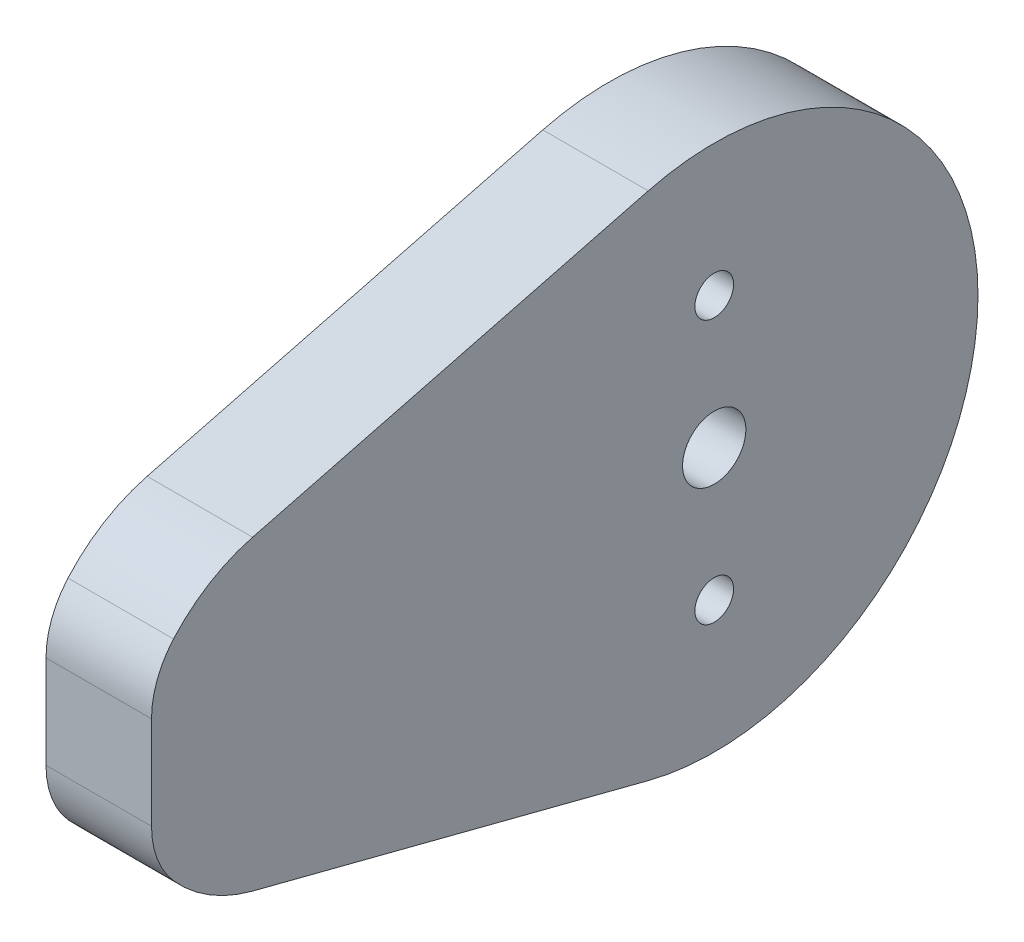
ISO-10303-21;
HEADER;
FILE_DESCRIPTION(('STEP AP214'),'2;1');
FILE_NAME('part.step','',(''),(''),'','','');
FILE_SCHEMA(('AUTOMOTIVE_DESIGN { 1 0 10303 214 1 1 1 1 }'));
ENDSEC;
DATA;
#1=APPLICATION_CONTEXT('core data for automotive mechanical design processes');
#2=APPLICATION_PROTOCOL_DEFINITION('international standard','automotive_design',2000,#1);
#3=PRODUCT_CONTEXT('',#1,'mechanical');
#4=PRODUCT('Part','Part','',(#3));
#5=PRODUCT_RELATED_PRODUCT_CATEGORY('part','',(#4));
#6=PRODUCT_DEFINITION_FORMATION('','',#4);
#7=PRODUCT_DEFINITION_CONTEXT('part definition',#1,'design');
#8=PRODUCT_DEFINITION('design','',#6,#7);
#9=PRODUCT_DEFINITION_SHAPE('','',#8);
#10=(LENGTH_UNIT() NAMED_UNIT(*) SI_UNIT(.MILLI.,.METRE.));
#11=(NAMED_UNIT(*) PLANE_ANGLE_UNIT() SI_UNIT($,.RADIAN.));
#12=(NAMED_UNIT(*) SI_UNIT($,.STERADIAN.) SOLID_ANGLE_UNIT());
#13=UNCERTAINTY_MEASURE_WITH_UNIT(LENGTH_MEASURE(1.E-05),#10,'distance_accuracy_value','');
#14=(GEOMETRIC_REPRESENTATION_CONTEXT(3) GLOBAL_UNCERTAINTY_ASSIGNED_CONTEXT((#13)) GLOBAL_UNIT_ASSIGNED_CONTEXT((#10,
#11,#12)) REPRESENTATION_CONTEXT('',''));
#15=CARTESIAN_POINT('',(0.,0.,0.));
#16=DIRECTION('',(0.,0.,1.));
#17=DIRECTION('',(1.,0.,0.));
#18=AXIS2_PLACEMENT_3D('',#15,#16,#17);
#19=CARTESIAN_POINT('',(6.,44.0457513110646,-34.1));
#20=DIRECTION('',(1.,0.,0.));
#21=DIRECTION('',(0.,0.,-1.));
#22=AXIS2_PLACEMENT_3D('',#19,#20,#21);
#23=PLANE('',#22);
#24=CARTESIAN_POINT('',(6.,48.9,-61.1));
#25=DIRECTION('',(1.,0.,0.));
#26=DIRECTION('',(0.,0.,1.));
#27=AXIS2_PLACEMENT_3D('',#24,#25,#26);
#28=CIRCLE('',#27,1.1);
#29=CARTESIAN_POINT('',(6.,48.9,-60.));
#30=VERTEX_POINT('',#29);
#31=EDGE_CURVE('E181',#30,#30,#28,.T.);
#32=ORIENTED_EDGE('',*,*,#31,.F.);
#33=EDGE_LOOP('',(#32));
#34=FACE_BOUND('',#33,.T.);
#35=CARTESIAN_POINT('',(6.,44.0457513110646,-34.1));
#36=DIRECTION('',(1.,0.,0.));
#37=DIRECTION('',(0.,0.,-1.));
#38=AXIS2_PLACEMENT_3D('',#35,#36,#37);
#39=CIRCLE('',#38,5.);
#40=CARTESIAN_POINT('',(6.,47.3529404498953,-30.35));
#41=VERTEX_POINT('',#40);
#42=CARTESIAN_POINT('',(6.,44.0457513110646,-29.1));
#43=VERTEX_POINT('',#42);
#44=EDGE_CURVE('E144',#41,#43,#39,.T.);
#45=ORIENTED_EDGE('',*,*,#44,.T.);
#46=DIRECTION('',(0.,-1.,0.));
#47=VECTOR('',#46,1.);
#48=CARTESIAN_POINT('',(6.,44.0457513110646,-29.1));
#49=LINE('',#48,#47);
#50=CARTESIAN_POINT('',(6.,38.7542486889354,-29.1));
#51=VERTEX_POINT('',#50);
#52=EDGE_CURVE('E92',#43,#51,#49,.T.);
#53=ORIENTED_EDGE('',*,*,#52,.T.);
#54=CARTESIAN_POINT('',(6.,38.7542486889354,-34.1));
#55=DIRECTION('',(1.,0.,0.));
#56=DIRECTION('',(0.,0.,-1.));
#57=AXIS2_PLACEMENT_3D('',#54,#55,#56);
#58=CIRCLE('',#57,5.);
#59=CARTESIAN_POINT('',(6.,35.4470595501047,-30.35));
#60=VERTEX_POINT('',#59);
#61=EDGE_CURVE('E159',#51,#60,#58,.T.);
#62=ORIENTED_EDGE('',*,*,#61,.T.);
#63=CARTESIAN_POINT('',(6.,41.4,-37.1));
#64=DIRECTION('',(1.,0.,0.));
#65=DIRECTION('',(0.,0.,-1.));
#66=AXIS2_PLACEMENT_3D('',#63,#64,#65);
#67=CIRCLE('',#66,9.00000000000001);
#68=CARTESIAN_POINT('',(6.,32.6857874710333,-34.85));
#69=VERTEX_POINT('',#68);
#70=EDGE_CURVE('E172',#60,#69,#67,.T.);
#71=ORIENTED_EDGE('',*,*,#70,.T.);
#72=DIRECTION('',(0.,-0.25,-0.968245836551854));
#73=VECTOR('',#72,1.);
#74=CARTESIAN_POINT('',(6.,32.6857874710333,-34.85));
#75=LINE('',#74,#73);
#76=CARTESIAN_POINT('',(6.,26.8763124517222,-57.35));
#77=VERTEX_POINT('',#76);
#78=EDGE_CURVE('E111',#69,#77,#75,.T.);
#79=ORIENTED_EDGE('',*,*,#78,.T.);
#80=CARTESIAN_POINT('',(6.,41.4,-61.1));
#81=DIRECTION('',(1.,0.,0.));
#82=DIRECTION('',(0.,0.,-1.));
#83=AXIS2_PLACEMENT_3D('',#80,#81,#82);
#84=CIRCLE('',#83,15.);
#85=CARTESIAN_POINT('',(6.,55.9236875482778,-57.35));
#86=VERTEX_POINT('',#85);
#87=EDGE_CURVE('E105',#77,#86,#84,.T.);
#88=ORIENTED_EDGE('',*,*,#87,.T.);
#89=DIRECTION('',(0.,-0.25,0.968245836551854));
#90=VECTOR('',#89,1.);
#91=CARTESIAN_POINT('',(6.,50.1142125289667,-34.85));
#92=LINE('',#91,#90);
#93=CARTESIAN_POINT('',(6.,50.1142125289667,-34.85));
#94=VERTEX_POINT('',#93);
#95=EDGE_CURVE('E109',#86,#94,#92,.T.);
#96=ORIENTED_EDGE('',*,*,#95,.T.);
#97=CARTESIAN_POINT('',(6.,41.4,-37.1));
#98=DIRECTION('',(1.,0.,0.));
#99=DIRECTION('',(0.,0.,-1.));
#100=AXIS2_PLACEMENT_3D('',#97,#98,#99);
#101=CIRCLE('',#100,9.);
#102=EDGE_CURVE('E49',#94,#41,#101,.T.);
#103=ORIENTED_EDGE('',*,*,#102,.T.);
#104=EDGE_LOOP('',(#45,#53,#62,#71,#79,#88,#96,#103));
#105=FACE_BOUND('',#104,.T.);
#106=CARTESIAN_POINT('',(6.,33.9,-61.1));
#107=DIRECTION('',(1.,0.,0.));
#108=DIRECTION('',(0.,0.,-1.));
#109=AXIS2_PLACEMENT_3D('',#106,#107,#108);
#110=CIRCLE('',#109,1.1);
#111=CARTESIAN_POINT('',(6.,33.9,-62.2));
#112=VERTEX_POINT('',#111);
#113=EDGE_CURVE('E133',#112,#112,#110,.T.);
#114=ORIENTED_EDGE('',*,*,#113,.F.);
#115=EDGE_LOOP('',(#114));
#116=FACE_BOUND('',#115,.T.);
#117=CARTESIAN_POINT('',(6.,41.4,-61.1));
#118=DIRECTION('',(1.,0.,0.));
#119=DIRECTION('',(0.,0.,-1.));
#120=AXIS2_PLACEMENT_3D('',#117,#118,#119);
#121=CIRCLE('',#120,1.79999999999999);
#122=CARTESIAN_POINT('',(6.,41.4,-62.9));
#123=VERTEX_POINT('',#122);
#124=EDGE_CURVE('E187',#123,#123,#121,.T.);
#125=ORIENTED_EDGE('',*,*,#124,.F.);
#126=EDGE_LOOP('',(#125));
#127=FACE_BOUND('',#126,.T.);
#128=ADVANCED_FACE('F32',(#34,#105,#116,#127),#23,.T.);
#129=CARTESIAN_POINT('',(0.,44.0457513110646,-34.1));
#130=DIRECTION('',(1.,0.,0.));
#131=DIRECTION('',(0.,0.,-1.));
#132=AXIS2_PLACEMENT_3D('',#129,#130,#131);
#133=PLANE('',#132);
#134=CARTESIAN_POINT('',(0.,48.9,-61.1));
#135=DIRECTION('',(1.,0.,0.));
#136=DIRECTION('',(0.,0.,1.));
#137=AXIS2_PLACEMENT_3D('',#134,#135,#136);
#138=CIRCLE('',#137,1.1);
#139=CARTESIAN_POINT('',(0.,48.9,-60.));
#140=VERTEX_POINT('',#139);
#141=EDGE_CURVE('E184',#140,#140,#138,.T.);
#142=ORIENTED_EDGE('',*,*,#141,.T.);
#143=EDGE_LOOP('',(#142));
#144=FACE_BOUND('',#143,.T.);
#145=CARTESIAN_POINT('',(0.,44.0457513110646,-34.1));
#146=DIRECTION('',(1.,0.,0.));
#147=DIRECTION('',(0.,0.,-1.));
#148=AXIS2_PLACEMENT_3D('',#145,#146,#147);
#149=CIRCLE('',#148,5.);
#150=CARTESIAN_POINT('',(0.,47.3529404498953,-30.35));
#151=VERTEX_POINT('',#150);
#152=CARTESIAN_POINT('',(0.,44.0457513110646,-29.1));
#153=VERTEX_POINT('',#152);
#154=EDGE_CURVE('E129',#151,#153,#149,.T.);
#155=ORIENTED_EDGE('',*,*,#154,.F.);
#156=CARTESIAN_POINT('',(0.,41.4,-37.1));
#157=DIRECTION('',(1.,0.,0.));
#158=DIRECTION('',(0.,0.,-1.));
#159=AXIS2_PLACEMENT_3D('',#156,#157,#158);
#160=CIRCLE('',#159,9.);
#161=CARTESIAN_POINT('',(0.,50.1142125289667,-34.85));
#162=VERTEX_POINT('',#161);
#163=EDGE_CURVE('E84',#162,#151,#160,.T.);
#164=ORIENTED_EDGE('',*,*,#163,.F.);
#165=DIRECTION('',(0.,-0.25,0.968245836551854));
#166=VECTOR('',#165,1.);
#167=CARTESIAN_POINT('',(0.,50.1142125289667,-34.85));
#168=LINE('',#167,#166);
#169=CARTESIAN_POINT('',(0.,55.9236875482778,-57.35));
#170=VERTEX_POINT('',#169);
#171=EDGE_CURVE('E78',#170,#162,#168,.T.);
#172=ORIENTED_EDGE('',*,*,#171,.F.);
#173=CARTESIAN_POINT('',(0.,41.4,-61.1));
#174=DIRECTION('',(1.,0.,0.));
#175=DIRECTION('',(0.,0.,-1.));
#176=AXIS2_PLACEMENT_3D('',#173,#174,#175);
#177=CIRCLE('',#176,15.);
#178=CARTESIAN_POINT('',(0.,26.8763124517222,-57.35));
#179=VERTEX_POINT('',#178);
#180=EDGE_CURVE('E119',#179,#170,#177,.T.);
#181=ORIENTED_EDGE('',*,*,#180,.F.);
#182=DIRECTION('',(0.,-0.25,-0.968245836551854));
#183=VECTOR('',#182,1.);
#184=CARTESIAN_POINT('',(0.,32.6857874710333,-34.85));
#185=LINE('',#184,#183);
#186=CARTESIAN_POINT('',(0.,32.6857874710333,-34.85));
#187=VERTEX_POINT('',#186);
#188=EDGE_CURVE('E139',#187,#179,#185,.T.);
#189=ORIENTED_EDGE('',*,*,#188,.F.);
#190=CARTESIAN_POINT('',(0.,41.4,-37.1));
#191=DIRECTION('',(1.,0.,0.));
#192=DIRECTION('',(0.,0.,-1.));
#193=AXIS2_PLACEMENT_3D('',#190,#191,#192);
#194=CIRCLE('',#193,9.00000000000001);
#195=CARTESIAN_POINT('',(0.,35.4470595501047,-30.35));
#196=VERTEX_POINT('',#195);
#197=EDGE_CURVE('E137',#196,#187,#194,.T.);
#198=ORIENTED_EDGE('',*,*,#197,.F.);
#199=CARTESIAN_POINT('',(0.,38.7542486889354,-34.1));
#200=DIRECTION('',(1.,0.,0.));
#201=DIRECTION('',(0.,0.,-1.));
#202=AXIS2_PLACEMENT_3D('',#199,#200,#201);
#203=CIRCLE('',#202,5.);
#204=CARTESIAN_POINT('',(0.,38.7542486889354,-29.1));
#205=VERTEX_POINT('',#204);
#206=EDGE_CURVE('E135',#205,#196,#203,.T.);
#207=ORIENTED_EDGE('',*,*,#206,.F.);
#208=DIRECTION('',(0.,-1.,0.));
#209=VECTOR('',#208,1.);
#210=CARTESIAN_POINT('',(0.,44.0457513110646,-29.1));
#211=LINE('',#210,#209);
#212=EDGE_CURVE('E132',#153,#205,#211,.T.);
#213=ORIENTED_EDGE('',*,*,#212,.F.);
#214=EDGE_LOOP('',(#155,#164,#172,#181,#189,#198,#207,#213));
#215=FACE_BOUND('',#214,.T.);
#216=CARTESIAN_POINT('',(0.,33.9,-61.1));
#217=DIRECTION('',(1.,0.,0.));
#218=DIRECTION('',(0.,0.,-1.));
#219=AXIS2_PLACEMENT_3D('',#216,#217,#218);
#220=CIRCLE('',#219,1.1);
#221=CARTESIAN_POINT('',(0.,33.9,-62.2));
#222=VERTEX_POINT('',#221);
#223=EDGE_CURVE('E178',#222,#222,#220,.T.);
#224=ORIENTED_EDGE('',*,*,#223,.T.);
#225=EDGE_LOOP('',(#224));
#226=FACE_BOUND('',#225,.T.);
#227=CARTESIAN_POINT('',(0.,41.4,-61.1));
#228=DIRECTION('',(1.,0.,0.));
#229=DIRECTION('',(0.,0.,-1.));
#230=AXIS2_PLACEMENT_3D('',#227,#228,#229);
#231=CIRCLE('',#230,1.79999999999999);
#232=CARTESIAN_POINT('',(0.,41.4,-62.9));
#233=VERTEX_POINT('',#232);
#234=EDGE_CURVE('E190',#233,#233,#231,.T.);
#235=ORIENTED_EDGE('',*,*,#234,.T.);
#236=EDGE_LOOP('',(#235));
#237=FACE_BOUND('',#236,.T.);
#238=ADVANCED_FACE('F163',(#144,#215,#226,#237),#133,.F.);
#239=CARTESIAN_POINT('',(6.,44.0457513110646,-34.1));
#240=DIRECTION('',(-1.,0.,0.));
#241=DIRECTION('',(0.,0.,1.));
#242=AXIS2_PLACEMENT_3D('',#239,#240,#241);
#243=CYLINDRICAL_SURFACE('',#242,5.);
#244=ORIENTED_EDGE('',*,*,#154,.T.);
#245=DIRECTION('',(-1.,0.,0.));
#246=VECTOR('',#245,1.);
#247=CARTESIAN_POINT('',(6.,44.0457513110646,-29.1));
#248=LINE('',#247,#246);
#249=EDGE_CURVE('E11',#43,#153,#248,.T.);
#250=ORIENTED_EDGE('',*,*,#249,.F.);
#251=ORIENTED_EDGE('',*,*,#44,.F.);
#252=DIRECTION('',(-1.,0.,0.));
#253=VECTOR('',#252,1.);
#254=CARTESIAN_POINT('',(6.,47.3529404498953,-30.35));
#255=LINE('',#254,#253);
#256=EDGE_CURVE('E125',#41,#151,#255,.T.);
#257=ORIENTED_EDGE('',*,*,#256,.T.);
#258=EDGE_LOOP('',(#244,#250,#251,#257));
#259=FACE_BOUND('',#258,.T.);
#260=ADVANCED_FACE('F34',(#259),#243,.T.);
#261=CARTESIAN_POINT('',(6.,44.0457513110646,-29.1));
#262=DIRECTION('',(0.,0.,-1.));
#263=DIRECTION('',(-1.,0.,0.));
#264=AXIS2_PLACEMENT_3D('',#261,#262,#263);
#265=PLANE('',#264);
#266=ORIENTED_EDGE('',*,*,#212,.T.);
#267=DIRECTION('',(-1.,0.,0.));
#268=VECTOR('',#267,1.);
#269=CARTESIAN_POINT('',(6.,38.7542486889354,-29.1));
#270=LINE('',#269,#268);
#271=EDGE_CURVE('E41',#51,#205,#270,.T.);
#272=ORIENTED_EDGE('',*,*,#271,.F.);
#273=ORIENTED_EDGE('',*,*,#52,.F.);
#274=ORIENTED_EDGE('',*,*,#249,.T.);
#275=EDGE_LOOP('',(#266,#272,#273,#274));
#276=FACE_BOUND('',#275,.T.);
#277=ADVANCED_FACE('F224',(#276),#265,.F.);
#278=CARTESIAN_POINT('',(6.,38.7542486889354,-34.1));
#279=DIRECTION('',(-1.,0.,0.));
#280=DIRECTION('',(0.,0.,1.));
#281=AXIS2_PLACEMENT_3D('',#278,#279,#280);
#282=CYLINDRICAL_SURFACE('',#281,5.);
#283=ORIENTED_EDGE('',*,*,#206,.T.);
#284=DIRECTION('',(-1.,0.,0.));
#285=VECTOR('',#284,1.);
#286=CARTESIAN_POINT('',(6.,35.4470595501047,-30.35));
#287=LINE('',#286,#285);
#288=EDGE_CURVE('E151',#60,#196,#287,.T.);
#289=ORIENTED_EDGE('',*,*,#288,.F.);
#290=ORIENTED_EDGE('',*,*,#61,.F.);
#291=ORIENTED_EDGE('',*,*,#271,.T.);
#292=EDGE_LOOP('',(#283,#289,#290,#291));
#293=FACE_BOUND('',#292,.T.);
#294=ADVANCED_FACE('F157',(#293),#282,.T.);
#295=CARTESIAN_POINT('',(6.,41.4,-37.1));
#296=DIRECTION('',(-1.,0.,0.));
#297=DIRECTION('',(0.,0.,1.));
#298=AXIS2_PLACEMENT_3D('',#295,#296,#297);
#299=CYLINDRICAL_SURFACE('',#298,9.00000000000001);
#300=ORIENTED_EDGE('',*,*,#197,.T.);
#301=DIRECTION('',(-1.,0.,0.));
#302=VECTOR('',#301,1.);
#303=CARTESIAN_POINT('',(6.,32.6857874710333,-34.85));
#304=LINE('',#303,#302);
#305=EDGE_CURVE('E148',#69,#187,#304,.T.);
#306=ORIENTED_EDGE('',*,*,#305,.F.);
#307=ORIENTED_EDGE('',*,*,#70,.F.);
#308=ORIENTED_EDGE('',*,*,#288,.T.);
#309=EDGE_LOOP('',(#300,#306,#307,#308));
#310=FACE_BOUND('',#309,.T.);
#311=ADVANCED_FACE('F168',(#310),#299,.T.);
#312=CARTESIAN_POINT('',(6.,32.6857874710333,-34.85));
#313=DIRECTION('',(0.,0.968245836551854,-0.25));
#314=DIRECTION('',(0.,0.25,0.968245836551854));
#315=AXIS2_PLACEMENT_3D('',#312,#313,#314);
#316=PLANE('',#315);
#317=ORIENTED_EDGE('',*,*,#188,.T.);
#318=DIRECTION('',(-1.,0.,0.));
#319=VECTOR('',#318,1.);
#320=CARTESIAN_POINT('',(6.,26.8763124517222,-57.35));
#321=LINE('',#320,#319);
#322=EDGE_CURVE('E120',#77,#179,#321,.T.);
#323=ORIENTED_EDGE('',*,*,#322,.F.);
#324=ORIENTED_EDGE('',*,*,#78,.F.);
#325=ORIENTED_EDGE('',*,*,#305,.T.);
#326=EDGE_LOOP('',(#317,#323,#324,#325));
#327=FACE_BOUND('',#326,.T.);
#328=ADVANCED_FACE('F171',(#327),#316,.F.);
#329=CARTESIAN_POINT('',(6.,41.4,-61.1));
#330=DIRECTION('',(-1.,0.,0.));
#331=DIRECTION('',(0.,0.,1.));
#332=AXIS2_PLACEMENT_3D('',#329,#330,#331);
#333=CYLINDRICAL_SURFACE('',#332,15.);
#334=ORIENTED_EDGE('',*,*,#180,.T.);
#335=DIRECTION('',(-1.,0.,0.));
#336=VECTOR('',#335,1.);
#337=CARTESIAN_POINT('',(6.,55.9236875482778,-57.35));
#338=LINE('',#337,#336);
#339=EDGE_CURVE('E116',#86,#170,#338,.T.);
#340=ORIENTED_EDGE('',*,*,#339,.F.);
#341=ORIENTED_EDGE('',*,*,#87,.F.);
#342=ORIENTED_EDGE('',*,*,#322,.T.);
#343=EDGE_LOOP('',(#334,#340,#341,#342));
#344=FACE_BOUND('',#343,.T.);
#345=ADVANCED_FACE('F117',(#344),#333,.T.);
#346=CARTESIAN_POINT('',(6.,50.1142125289667,-34.85));
#347=DIRECTION('',(0.,-0.968245836551854,-0.25));
#348=DIRECTION('',(0.,0.25,-0.968245836551854));
#349=AXIS2_PLACEMENT_3D('',#346,#347,#348);
#350=PLANE('',#349);
#351=ORIENTED_EDGE('',*,*,#171,.T.);
#352=DIRECTION('',(-1.,0.,0.));
#353=VECTOR('',#352,1.);
#354=CARTESIAN_POINT('',(6.,50.1142125289667,-34.85));
#355=LINE('',#354,#353);
#356=EDGE_CURVE('E121',#94,#162,#355,.T.);
#357=ORIENTED_EDGE('',*,*,#356,.F.);
#358=ORIENTED_EDGE('',*,*,#95,.F.);
#359=ORIENTED_EDGE('',*,*,#339,.T.);
#360=EDGE_LOOP('',(#351,#357,#358,#359));
#361=FACE_BOUND('',#360,.T.);
#362=ADVANCED_FACE('F123',(#361),#350,.F.);
#363=CARTESIAN_POINT('',(6.,41.4,-37.1));
#364=DIRECTION('',(-1.,0.,0.));
#365=DIRECTION('',(0.,0.,1.));
#366=AXIS2_PLACEMENT_3D('',#363,#364,#365);
#367=CYLINDRICAL_SURFACE('',#366,9.);
#368=ORIENTED_EDGE('',*,*,#163,.T.);
#369=ORIENTED_EDGE('',*,*,#256,.F.);
#370=ORIENTED_EDGE('',*,*,#102,.F.);
#371=ORIENTED_EDGE('',*,*,#356,.T.);
#372=EDGE_LOOP('',(#368,#369,#370,#371));
#373=FACE_BOUND('',#372,.T.);
#374=ADVANCED_FACE('F212',(#373),#367,.T.);
#375=CARTESIAN_POINT('',(6.,33.9,-61.1));
#376=DIRECTION('',(-1.,0.,0.));
#377=DIRECTION('',(0.,0.,1.));
#378=AXIS2_PLACEMENT_3D('',#375,#376,#377);
#379=CYLINDRICAL_SURFACE('',#378,1.1);
#380=ORIENTED_EDGE('',*,*,#113,.T.);
#381=EDGE_LOOP('',(#380));
#382=FACE_BOUND('',#381,.T.);
#383=ORIENTED_EDGE('',*,*,#223,.F.);
#384=EDGE_LOOP('',(#383));
#385=FACE_BOUND('',#384,.T.);
#386=ADVANCED_FACE('F209',(#382,#385),#379,.F.);
#387=CARTESIAN_POINT('',(6.,48.9,-61.1));
#388=DIRECTION('',(-1.,0.,0.));
#389=DIRECTION('',(0.,0.,1.));
#390=AXIS2_PLACEMENT_3D('',#387,#388,#389);
#391=CYLINDRICAL_SURFACE('',#390,1.1);
#392=ORIENTED_EDGE('',*,*,#31,.T.);
#393=EDGE_LOOP('',(#392));
#394=FACE_BOUND('',#393,.T.);
#395=ORIENTED_EDGE('',*,*,#141,.F.);
#396=EDGE_LOOP('',(#395));
#397=FACE_BOUND('',#396,.T.);
#398=ADVANCED_FACE('F288',(#394,#397),#391,.F.);
#399=CARTESIAN_POINT('',(6.,41.4,-61.1));
#400=DIRECTION('',(-1.,0.,0.));
#401=DIRECTION('',(0.,0.,1.));
#402=AXIS2_PLACEMENT_3D('',#399,#400,#401);
#403=CYLINDRICAL_SURFACE('',#402,1.79999999999999);
#404=ORIENTED_EDGE('',*,*,#124,.T.);
#405=EDGE_LOOP('',(#404));
#406=FACE_BOUND('',#405,.T.);
#407=ORIENTED_EDGE('',*,*,#234,.F.);
#408=EDGE_LOOP('',(#407));
#409=FACE_BOUND('',#408,.T.);
#410=ADVANCED_FACE('F196',(#406,#409),#403,.F.);
#411=CLOSED_SHELL('',(#128,#238,#260,#277,#294,#311,#328,#345,#362,#374,#386,#398,#410));
#412=MANIFOLD_SOLID_BREP('B2',#411);
#413=ADVANCED_BREP_SHAPE_REPRESENTATION('',(#18,#412),#14);
#414=SHAPE_DEFINITION_REPRESENTATION(#9,#413);
ENDSEC;
END-ISO-10303-21;
